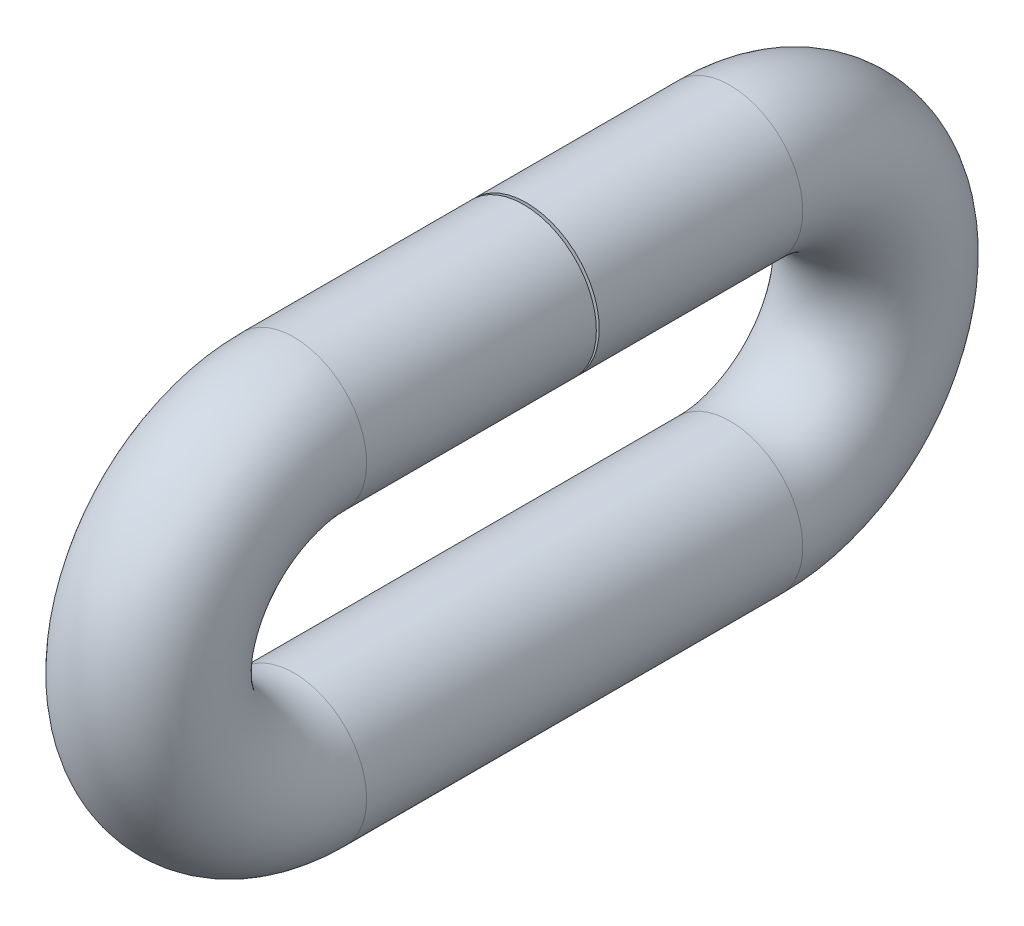
ISO-10303-21;
HEADER;
FILE_DESCRIPTION(('STEP AP214'),'2;1');
FILE_NAME('part.step','',(''),(''),'','','');
FILE_SCHEMA(('AUTOMOTIVE_DESIGN { 1 0 10303 214 1 1 1 1 }'));
ENDSEC;
DATA;
#1=APPLICATION_CONTEXT('core data for automotive mechanical design processes');
#2=APPLICATION_PROTOCOL_DEFINITION('international standard','automotive_design',2000,#1);
#3=PRODUCT_CONTEXT('',#1,'mechanical');
#4=PRODUCT('Part','Part','',(#3));
#5=PRODUCT_RELATED_PRODUCT_CATEGORY('part','',(#4));
#6=PRODUCT_DEFINITION_FORMATION('','',#4);
#7=PRODUCT_DEFINITION_CONTEXT('part definition',#1,'design');
#8=PRODUCT_DEFINITION('design','',#6,#7);
#9=PRODUCT_DEFINITION_SHAPE('','',#8);
#10=(LENGTH_UNIT() NAMED_UNIT(*) SI_UNIT(.MILLI.,.METRE.));
#11=(NAMED_UNIT(*) PLANE_ANGLE_UNIT() SI_UNIT($,.RADIAN.));
#12=(NAMED_UNIT(*) SI_UNIT($,.STERADIAN.) SOLID_ANGLE_UNIT());
#13=UNCERTAINTY_MEASURE_WITH_UNIT(LENGTH_MEASURE(1.E-05),#10,'distance_accuracy_value','');
#14=(GEOMETRIC_REPRESENTATION_CONTEXT(3) GLOBAL_UNCERTAINTY_ASSIGNED_CONTEXT((#13)) GLOBAL_UNIT_ASSIGNED_CONTEXT((#10,
#11,#12)) REPRESENTATION_CONTEXT('',''));
#15=CARTESIAN_POINT('',(0.,0.,0.));
#16=DIRECTION('',(0.,0.,1.));
#17=DIRECTION('',(1.,0.,0.));
#18=AXIS2_PLACEMENT_3D('',#15,#16,#17);
#19=CARTESIAN_POINT('',(0.,0.,0.));
#20=DIRECTION('',(0.,0.,1.));
#21=DIRECTION('',(1.,0.,0.));
#22=AXIS2_PLACEMENT_3D('',#19,#20,#21);
#23=PLANE('',#22);
#24=CARTESIAN_POINT('',(0.,0.,0.));
#25=DIRECTION('',(0.,0.,1.));
#26=DIRECTION('',(1.,0.,0.));
#27=AXIS2_PLACEMENT_3D('',#24,#25,#26);
#28=CIRCLE('',#27,63.5);
#29=CARTESIAN_POINT('',(63.5,0.,0.));
#30=VERTEX_POINT('',#29);
#31=EDGE_CURVE('E49',#30,#30,#28,.T.);
#32=ORIENTED_EDGE('',*,*,#31,.T.);
#33=EDGE_LOOP('',(#32));
#34=FACE_BOUND('',#33,.T.);
#35=ADVANCED_FACE('F37',(#34),#23,.T.);
#36=CARTESIAN_POINT('',(0.,0.,2.53999999999999));
#37=DIRECTION('',(0.,0.,1.));
#38=DIRECTION('',(1.,0.,0.));
#39=AXIS2_PLACEMENT_3D('',#36,#37,#38);
#40=PLANE('',#39);
#41=CARTESIAN_POINT('',(0.,0.,2.53999999999999));
#42=DIRECTION('',(0.,0.,1.));
#43=DIRECTION('',(1.,0.,0.));
#44=AXIS2_PLACEMENT_3D('',#41,#42,#43);
#45=CIRCLE('',#44,63.5);
#46=CARTESIAN_POINT('',(63.5,0.,2.53999999999999));
#47=VERTEX_POINT('',#46);
#48=EDGE_CURVE('E11',#47,#47,#45,.T.);
#49=ORIENTED_EDGE('',*,*,#48,.F.);
#50=EDGE_LOOP('',(#49));
#51=FACE_BOUND('',#50,.T.);
#52=ADVANCED_FACE('F55',(#51),#40,.F.);
#53=CARTESIAN_POINT('',(0.,0.,0.));
#54=DIRECTION('',(0.,0.,-1.));
#55=DIRECTION('',(-1.,0.,0.));
#56=AXIS2_PLACEMENT_3D('',#53,#54,#55);
#57=CYLINDRICAL_SURFACE('',#56,63.5);
#58=CARTESIAN_POINT('',(0.,0.,-177.8));
#59=DIRECTION('',(0.,0.,1.));
#60=DIRECTION('',(1.,0.,0.));
#61=AXIS2_PLACEMENT_3D('',#58,#59,#60);
#62=CIRCLE('',#61,63.5);
#63=CARTESIAN_POINT('',(0.,63.5,-177.8));
#64=VERTEX_POINT('',#63);
#65=EDGE_CURVE('E89',#64,#64,#62,.T.);
#66=ORIENTED_EDGE('',*,*,#65,.T.);
#67=EDGE_LOOP('',(#66));
#68=FACE_BOUND('',#67,.T.);
#69=ORIENTED_EDGE('',*,*,#31,.F.);
#70=EDGE_LOOP('',(#69));
#71=FACE_BOUND('',#70,.T.);
#72=ADVANCED_FACE('F57',(#68,#71),#57,.T.);
#73=CARTESIAN_POINT('',(0.,-127.,-177.8));
#74=DIRECTION('',(-1.,0.,0.));
#75=DIRECTION('',(0.,0.,1.));
#76=AXIS2_PLACEMENT_3D('',#73,#74,#75);
#77=TOROIDAL_SURFACE('',#76,127.,63.5);
#78=CARTESIAN_POINT('',(0.,-254.,-177.8));
#79=DIRECTION('',(0.,0.,-1.));
#80=DIRECTION('',(1.,0.,0.));
#81=AXIS2_PLACEMENT_3D('',#78,#79,#80);
#82=CIRCLE('',#81,63.5);
#83=CARTESIAN_POINT('',(0.,-317.5,-177.8));
#84=VERTEX_POINT('',#83);
#85=EDGE_CURVE('E86',#84,#84,#82,.T.);
#86=CARTESIAN_POINT('',(0.,-127.,-177.8));
#87=DIRECTION('',(-1.,0.,0.));
#88=DIRECTION('',(0.,0.,1.));
#89=AXIS2_PLACEMENT_3D('',#86,#87,#88);
#90=CIRCLE('',#89,190.5);
#91=EDGE_CURVE('',#64,#84,#90,.T.);
#92=ORIENTED_EDGE('',*,*,#65,.F.);
#93=ORIENTED_EDGE('',*,*,#85,.T.);
#94=ORIENTED_EDGE('',*,*,#91,.T.);
#95=ORIENTED_EDGE('',*,*,#91,.F.);
#96=EDGE_LOOP('',(#92,#94,#93,#95));
#97=FACE_BOUND('',#96,.T.);
#98=ADVANCED_FACE('F62',(#97),#77,.T.);
#99=CARTESIAN_POINT('',(0.,-254.,-177.8));
#100=DIRECTION('',(0.,0.,1.));
#101=DIRECTION('',(1.,0.,0.));
#102=AXIS2_PLACEMENT_3D('',#99,#100,#101);
#103=CYLINDRICAL_SURFACE('',#102,63.5);
#104=CARTESIAN_POINT('',(0.,-254.,203.2));
#105=DIRECTION('',(0.,0.,-1.));
#106=DIRECTION('',(1.,0.,0.));
#107=AXIS2_PLACEMENT_3D('',#104,#105,#106);
#108=CIRCLE('',#107,63.5);
#109=CARTESIAN_POINT('',(0.,-317.5,203.2));
#110=VERTEX_POINT('',#109);
#111=EDGE_CURVE('E91',#110,#110,#108,.T.);
#112=ORIENTED_EDGE('',*,*,#111,.T.);
#113=EDGE_LOOP('',(#112));
#114=FACE_BOUND('',#113,.T.);
#115=ORIENTED_EDGE('',*,*,#85,.F.);
#116=EDGE_LOOP('',(#115));
#117=FACE_BOUND('',#116,.T.);
#118=ADVANCED_FACE('F72',(#114,#117),#103,.T.);
#119=CARTESIAN_POINT('',(0.,-127.,203.2));
#120=DIRECTION('',(-1.,0.,0.));
#121=DIRECTION('',(0.,0.,1.));
#122=AXIS2_PLACEMENT_3D('',#119,#120,#121);
#123=TOROIDAL_SURFACE('',#122,127.,63.5);
#124=CARTESIAN_POINT('',(0.,0.,203.2));
#125=DIRECTION('',(0.,0.,1.));
#126=DIRECTION('',(1.,0.,0.));
#127=AXIS2_PLACEMENT_3D('',#124,#125,#126);
#128=CIRCLE('',#127,63.5);
#129=CARTESIAN_POINT('',(0.,63.5,203.2));
#130=VERTEX_POINT('',#129);
#131=EDGE_CURVE('E44',#130,#130,#128,.T.);
#132=CARTESIAN_POINT('',(0.,-127.,203.2));
#133=DIRECTION('',(-1.,0.,0.));
#134=DIRECTION('',(0.,0.,1.));
#135=AXIS2_PLACEMENT_3D('',#132,#133,#134);
#136=CIRCLE('',#135,190.5);
#137=EDGE_CURVE('',#110,#130,#136,.T.);
#138=ORIENTED_EDGE('',*,*,#111,.F.);
#139=ORIENTED_EDGE('',*,*,#131,.T.);
#140=ORIENTED_EDGE('',*,*,#137,.T.);
#141=ORIENTED_EDGE('',*,*,#137,.F.);
#142=EDGE_LOOP('',(#138,#140,#139,#141));
#143=FACE_BOUND('',#142,.T.);
#144=ADVANCED_FACE('F68',(#143),#123,.T.);
#145=CARTESIAN_POINT('',(0.,0.,203.2));
#146=DIRECTION('',(0.,0.,-1.));
#147=DIRECTION('',(-1.,0.,0.));
#148=AXIS2_PLACEMENT_3D('',#145,#146,#147);
#149=CYLINDRICAL_SURFACE('',#148,63.5);
#150=ORIENTED_EDGE('',*,*,#48,.T.);
#151=EDGE_LOOP('',(#150));
#152=FACE_BOUND('',#151,.T.);
#153=ORIENTED_EDGE('',*,*,#131,.F.);
#154=EDGE_LOOP('',(#153));
#155=FACE_BOUND('',#154,.T.);
#156=ADVANCED_FACE('F52',(#152,#155),#149,.T.);
#157=CLOSED_SHELL('',(#35,#52,#72,#98,#118,#144,#156));
#158=MANIFOLD_SOLID_BREP('B2',#157);
#159=ADVANCED_BREP_SHAPE_REPRESENTATION('',(#18,#158),#14);
#160=SHAPE_DEFINITION_REPRESENTATION(#9,#159);
ENDSEC;
END-ISO-10303-21;
